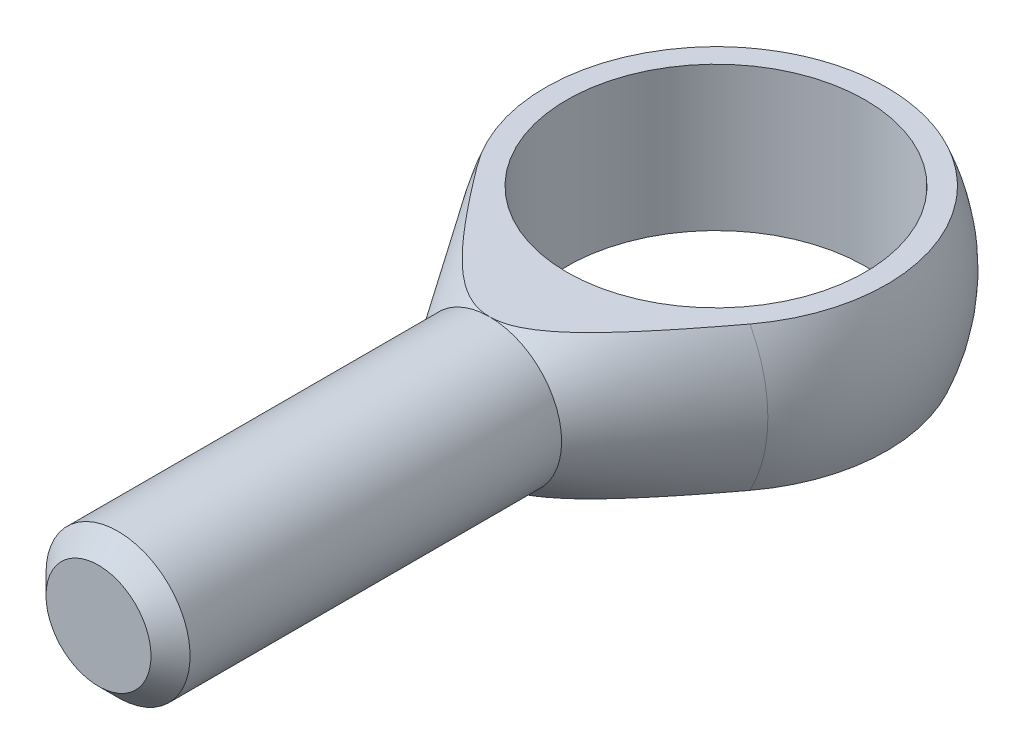
ISO-10303-21;
HEADER;
FILE_DESCRIPTION(('STEP AP214'),'2;1');
FILE_NAME('part.step','',(''),(''),'','','');
FILE_SCHEMA(('AUTOMOTIVE_DESIGN { 1 0 10303 214 1 1 1 1 }'));
ENDSEC;
DATA;
#1=APPLICATION_CONTEXT('core data for automotive mechanical design processes');
#2=APPLICATION_PROTOCOL_DEFINITION('international standard','automotive_design',2000,#1);
#3=PRODUCT_CONTEXT('',#1,'mechanical');
#4=PRODUCT('Part','Part','',(#3));
#5=PRODUCT_RELATED_PRODUCT_CATEGORY('part','',(#4));
#6=PRODUCT_DEFINITION_FORMATION('','',#4);
#7=PRODUCT_DEFINITION_CONTEXT('part definition',#1,'design');
#8=PRODUCT_DEFINITION('design','',#6,#7);
#9=PRODUCT_DEFINITION_SHAPE('','',#8);
#10=(LENGTH_UNIT() NAMED_UNIT(*) SI_UNIT(.MILLI.,.METRE.));
#11=(NAMED_UNIT(*) PLANE_ANGLE_UNIT() SI_UNIT($,.RADIAN.));
#12=(NAMED_UNIT(*) SI_UNIT($,.STERADIAN.) SOLID_ANGLE_UNIT());
#13=UNCERTAINTY_MEASURE_WITH_UNIT(LENGTH_MEASURE(1.E-05),#10,'distance_accuracy_value','');
#14=(GEOMETRIC_REPRESENTATION_CONTEXT(3) GLOBAL_UNCERTAINTY_ASSIGNED_CONTEXT((#13)) GLOBAL_UNIT_ASSIGNED_CONTEXT((#10,
#11,#12)) REPRESENTATION_CONTEXT('',''));
#15=CARTESIAN_POINT('',(0.,0.,0.));
#16=DIRECTION('',(0.,0.,1.));
#17=DIRECTION('',(1.,0.,0.));
#18=AXIS2_PLACEMENT_3D('',#15,#16,#17);
#19=CARTESIAN_POINT('',(0.,0.,22.));
#20=DIRECTION('',(0.,0.,-1.));
#21=DIRECTION('',(-1.,0.,0.));
#22=AXIS2_PLACEMENT_3D('',#19,#20,#21);
#23=CONICAL_SURFACE('',#22,7.,0.586080353273644);
#24=CARTESIAN_POINT('',(0.,0.,9.95579574269246));
#25=DIRECTION('',(0.,0.,-1.));
#26=DIRECTION('',(-1.,0.,0.));
#27=AXIS2_PLACEMENT_3D('',#24,#25,#26);
#28=CIRCLE('',#27,14.9960705229666);
#29=CARTESIAN_POINT('',(-13.2620560672087,-7.,9.95579574269246));
#30=VERTEX_POINT('',#29);
#31=CARTESIAN_POINT('',(-13.2620560672087,7.,9.95579574269246));
#32=VERTEX_POINT('',#31);
#33=EDGE_CURVE('E97',#30,#32,#28,.T.);
#34=ORIENTED_EDGE('',*,*,#33,.F.);
#35=CARTESIAN_POINT('',(-35.7749330406198,-7.,-22.364543191274));
#36=CARTESIAN_POINT('',(-35.2557457418538,-7.,-21.5970666918137));
#37=CARTESIAN_POINT('',(-34.7362762210325,-7.,-20.8297811400058));
#38=CARTESIAN_POINT('',(-33.6966834144319,-7.,-19.2956524673114));
#39=CARTESIAN_POINT('',(-33.176560128298,-7.,-18.5288093466651));
#40=CARTESIAN_POINT('',(-31.6149481261384,-7.,-16.2288466338894));
#41=CARTESIAN_POINT('',(-30.5723452600432,-7.,-14.6964829896334));
#42=CARTESIAN_POINT('',(-28.4792793196588,-7.,-11.6287926346319));
#43=CARTESIAN_POINT('',(-27.4288014344379,-7.,-10.0934760258834));
#44=CARTESIAN_POINT('',(-25.3224132619239,-7.,-7.02683031825795));
#45=CARTESIAN_POINT('',(-24.2665036180706,-7.,-5.49550077803563));
#46=CARTESIAN_POINT('',(-22.6197204042876,-7.,-3.12071896107828));
#47=CARTESIAN_POINT('',(-22.0316497439147,-7.,-2.27532350169602));
#48=CARTESIAN_POINT('',(-20.8523754110616,-7.,-0.586721538908334));
#49=CARTESIAN_POINT('',(-20.261171744375,-7.,0.256484968540639));
#50=CARTESIAN_POINT('',(-19.0745404522942,-7.,1.94039790687613));
#51=CARTESIAN_POINT('',(-18.479111322321,-7.,2.78110327856402));
#52=CARTESIAN_POINT('',(-17.283024706769,-7.,4.45875767536112));
#53=CARTESIAN_POINT('',(-16.6823673535929,-7.,5.29570679478707));
#54=CARTESIAN_POINT('',(-15.4753430188765,-7.,6.96269811189941));
#55=CARTESIAN_POINT('',(-14.8689914367507,-7.,7.79275142729022));
#56=CARTESIAN_POINT('',(-13.9520975640749,-7.,9.03245633424442));
#57=CARTESIAN_POINT('',(-13.6452208819987,-7.,9.44481873024202));
#58=CARTESIAN_POINT('',(-13.0285191148171,-7.,10.2673324129423));
#59=CARTESIAN_POINT('',(-12.7186940433328,-7.,10.6774837098463));
#60=CARTESIAN_POINT('',(-12.0956715350432,-7.,11.4948106695872));
#61=CARTESIAN_POINT('',(-11.7824763504141,-7.,11.9019880473005));
#62=CARTESIAN_POINT('',(-11.1517095906708,-7.,12.7129374332678));
#63=CARTESIAN_POINT('',(-10.8341380686633,-7.,13.1167094827497));
#64=CARTESIAN_POINT('',(-10.1935897495339,-7.,13.9198283190024));
#65=CARTESIAN_POINT('',(-9.87061395256993,-7.,14.3191759023512));
#66=CARTESIAN_POINT('',(-9.21774476320522,-7.,15.1121662786666));
#67=CARTESIAN_POINT('',(-8.88785179033026,-7.,15.5058094151724));
#68=CARTESIAN_POINT('',(-8.47330461901117,-7.,15.9890251921758));
#69=CARTESIAN_POINT('',(-8.39288771792456,-7.,16.0822397626497));
#70=CARTESIAN_POINT('',(-8.23149652455924,-7.,16.2681860780628));
#71=CARTESIAN_POINT('',(-8.15052222922019,-7.,16.3609178203461));
#72=CARTESIAN_POINT('',(-7.90670329867922,-7.,16.6383368353352));
#73=CARTESIAN_POINT('',(-7.74296708261695,-7.,16.8222426839337));
#74=CARTESIAN_POINT('',(-7.41269551183481,-7.,17.187669240366));
#75=CARTESIAN_POINT('',(-7.24615899128196,-7.,17.3691888957787));
#76=CARTESIAN_POINT('',(-6.90993072460535,-7.,17.7292828947874));
#77=CARTESIAN_POINT('',(-6.74023902707467,-7.,17.907857283664));
#78=CARTESIAN_POINT('',(-6.39832456051447,-7.,18.2602745619847));
#79=CARTESIAN_POINT('',(-6.22612614934961,-7.,18.4341410297398));
#80=CARTESIAN_POINT('',(-5.87750130265463,-7.,18.777578750902));
#81=CARTESIAN_POINT('',(-5.70107507321759,-7.,18.9471502128518));
#82=CARTESIAN_POINT('',(-5.34334844564706,-7.,19.2808802367186));
#83=CARTESIAN_POINT('',(-5.16205090731351,-7.,19.4450418537778));
#84=CARTESIAN_POINT('',(-4.7936214362123,-7.,19.7666557471395));
#85=CARTESIAN_POINT('',(-4.60649059922228,-7.,19.9241092705527));
#86=CARTESIAN_POINT('',(-4.26948714608075,-7.,20.1949425491286));
#87=CARTESIAN_POINT('',(-4.12103022034314,-7.,20.3100799649733));
#88=CARTESIAN_POINT('',(-3.81949091420309,-7.,20.5341606496789));
#89=CARTESIAN_POINT('',(-3.66640858152046,-7.,20.64310398241));
#90=CARTESIAN_POINT('',(-3.35471148915117,-7.,20.8535847470688));
#91=CARTESIAN_POINT('',(-3.19608530103455,-7.,20.9551053619598));
#92=CARTESIAN_POINT('',(-2.87306914673421,-7.,21.148627208181));
#93=CARTESIAN_POINT('',(-2.70867878773045,-7.,21.2406277890396));
#94=CARTESIAN_POINT('',(-2.3705669601187,-7.,21.4144147823643));
#95=CARTESIAN_POINT('',(-2.19672767573215,-7.,21.4959744915405));
#96=CARTESIAN_POINT('',(-1.84259733991625,-7.,21.6438391418119));
#97=CARTESIAN_POINT('',(-1.66230650330884,-7.,21.7101445902939));
#98=CARTESIAN_POINT('',(-1.29677977192926,-7.,21.8239610010033));
#99=CARTESIAN_POINT('',(-1.11157296335153,-7.,21.871563884485));
#100=CARTESIAN_POINT('',(-0.736937715346063,-7.,21.945412636619));
#101=CARTESIAN_POINT('',(-0.547511238142772,-7.,21.9716682276162));
#102=CARTESIAN_POINT('',(-0.193652612813675,-7.,21.9988392502901));
#103=CARTESIAN_POINT('',(-0.0294516562980215,-7.,22.0027989505114));
#104=CARTESIAN_POINT('',(0.298435483918341,-7.,21.9933092028262));
#105=CARTESIAN_POINT('',(0.462121701717755,-7.,21.9798609335421));
#106=CARTESIAN_POINT('',(0.787583203686881,-7.,21.9362904703374));
#107=CARTESIAN_POINT('',(0.949353614789869,-7.,21.906132439325));
#108=CARTESIAN_POINT('',(1.26931315408095,-7.,21.8307037570719));
#109=CARTESIAN_POINT('',(1.42750145035563,-7.,21.7854296329253));
#110=CARTESIAN_POINT('',(1.77988046427218,-7.,21.6683217875983));
#111=CARTESIAN_POINT('',(1.97278746842812,-7.,21.5926463734846));
#112=CARTESIAN_POINT('',(2.35109490226876,-7.,21.4245050560995));
#113=CARTESIAN_POINT('',(2.53649215764712,-7.,21.3320321414028));
#114=CARTESIAN_POINT('',(2.90051798006167,-7.,21.133548885041));
#115=CARTESIAN_POINT('',(3.07912517025464,-7.,21.0274997504075));
#116=CARTESIAN_POINT('',(3.4295875329644,-7.,20.8049541113989));
#117=CARTESIAN_POINT('',(3.60144431341052,-7.,20.6884601169308));
#118=CARTESIAN_POINT('',(3.91191222623654,-7.,20.4666964111047));
#119=CARTESIAN_POINT('',(4.05140788374108,-7.,20.3626550537725));
#120=CARTESIAN_POINT('',(4.32667190571702,-7.,20.1497406643287));
#121=CARTESIAN_POINT('',(4.46243986853867,-7.,20.0408671148418));
#122=CARTESIAN_POINT('',(4.86492235875525,-7.,19.7081280613203));
#123=CARTESIAN_POINT('',(5.12666880117029,-7.,19.4782513743433));
#124=CARTESIAN_POINT('',(5.64027049450144,-7.,19.0066261457026));
#125=CARTESIAN_POINT('',(5.89210027214738,-7.,18.7648502168376));
#126=CARTESIAN_POINT('',(6.38732226614094,-7.,18.2729754493109));
#127=CARTESIAN_POINT('',(6.63071679155033,-7.,18.022878925658));
#128=CARTESIAN_POINT('',(7.112269520069,-7.,17.5147782469323));
#129=CARTESIAN_POINT('',(7.35038600362861,-7.,17.256734737553));
#130=CARTESIAN_POINT('',(7.821107988416,-7.,16.7356564961187));
#131=CARTESIAN_POINT('',(8.05371316828983,-7.,16.4726214746205));
#132=CARTESIAN_POINT('',(8.51402439097885,-7.,15.943023137621));
#133=CARTESIAN_POINT('',(8.7417374626886,-7.,15.6764659167488));
#134=CARTESIAN_POINT('',(9.19338997581038,-7.,15.1401932236206));
#135=CARTESIAN_POINT('',(9.41732953446576,-7.,14.8704778499315));
#136=CARTESIAN_POINT('',(9.85842553695496,-7.,14.3328639579327));
#137=CARTESIAN_POINT('',(10.0756330613075,-7.,14.0650072912833));
#138=CARTESIAN_POINT('',(10.5074407732847,-7.,13.5271990914724));
#139=CARTESIAN_POINT('',(10.7220409363361,-7.,13.2572475386068));
#140=CARTESIAN_POINT('',(11.3625220510265,-7.,12.4447395150769));
#141=CARTESIAN_POINT('',(11.7850655390273,-7.,11.8995518675478));
#142=CARTESIAN_POINT('',(12.6235427441418,-7.,10.8039817775548));
#143=CARTESIAN_POINT('',(13.0394752696116,-7.,10.2535984264213));
#144=CARTESIAN_POINT('',(13.8661746140222,-7.,9.14896127950245));
#145=CARTESIAN_POINT('',(14.2769413791678,-7.,8.59470744350407));
#146=CARTESIAN_POINT('',(15.0948308380742,-7.,7.482617949876));
#147=CARTESIAN_POINT('',(15.5019492176313,-7.,6.92477912363595));
#148=CARTESIAN_POINT('',(16.312907899028,-7.,5.8067215840899));
#149=CARTESIAN_POINT('',(16.7167481847817,-7.,5.24650285912593));
#150=CARTESIAN_POINT('',(17.5217113458166,-7.,4.12421135621869));
#151=CARTESIAN_POINT('',(17.9228345158846,-7.,3.56213878957017));
#152=CARTESIAN_POINT('',(18.7228697941856,-7.,2.43642225680694));
#153=CARTESIAN_POINT('',(19.1217818999099,-7.,1.87277828891023));
#154=CARTESIAN_POINT('',(20.3121285599489,-7.,0.185060271051221));
#155=CARTESIAN_POINT('',(21.1008432418333,-7.,-0.940932001672015));
#156=CARTESIAN_POINT('',(22.6730668043922,-7.,-3.19658296464595));
#157=CARTESIAN_POINT('',(23.4565755487086,-7.,-4.32624174978839));
#158=CARTESIAN_POINT('',(25.0193558881569,-7.,-6.58778112055454));
#159=CARTESIAN_POINT('',(25.7986291312,-7.,-7.71966056796844));
#160=CARTESIAN_POINT('',(27.3541881344403,-7.,-9.98547051992714));
#161=CARTESIAN_POINT('',(28.1304738925979,-7.,-11.1194010258715));
#162=CARTESIAN_POINT('',(29.479603864552,-7.,-13.0944636179223));
#163=CARTESIAN_POINT('',(30.0529771608741,-7.,-13.9352344525402));
#164=CARTESIAN_POINT('',(31.1986850021324,-7.,-15.6175888971328));
#165=CARTESIAN_POINT('',(31.7710194539251,-7.,-16.459172570535));
#166=CARTESIAN_POINT('',(32.915767397702,-7.,-18.1444464753605));
#167=CARTESIAN_POINT('',(33.4881792638798,-7.,-18.9881378109397));
#168=CARTESIAN_POINT('',(34.6321510704091,-7.,-20.6759910229837));
#169=CARTESIAN_POINT('',(35.2037110803881,-7.,-21.5201528522547));
#170=CARTESIAN_POINT('',(35.7749330406198,-7.,-22.364543191274));
#171=B_SPLINE_CURVE_WITH_KNOTS('',3,(#35,#36,#37,#38,#39,#40,#41,#42,#43,#44,#45,#46,#47,#48,
#49,#50,#51,#52,#53,#54,#55,#56,#57,#58,#59,#60,#61,#62,#63,#64,#65,#66,#67,#68,#69,#70,#71,#72,
#73,#74,#75,#76,#77,#78,#79,#80,#81,#82,#83,#84,#85,#86,#87,#88,#89,#90,#91,#92,#93,#94,#95,#96,
#97,#98,#99,#100,#101,#102,#103,#104,#105,#106,#107,#108,#109,#110,#111,#112,#113,#114,#115,
#116,#117,#118,#119,#120,#121,#122,#123,#124,#125,#126,#127,#128,#129,#130,#131,#132,#133,#134,
#135,#136,#137,#138,#139,#140,#141,#142,#143,#144,#145,#146,#147,#148,#149,#150,#151,#152,#153,
#154,#155,#156,#157,#158,#159,#160,#161,#162,#163,#164,#165,#166,#167,#168,#169,#170),
.UNSPECIFIED.,.F.,.F.,(4,2,2,2,2,2,2,2,2,2,2,2,2,2,2,2,2,2,2,2,2,2,2,2,2,2,2,2,2,2,2,2,2,2,2,2,
2,2,2,2,2,2,2,2,2,2,2,2,2,2,2,2,2,2,2,2,2,2,2,2,2,2,2,2,2,2,2,4),(0.,2.77978052532656,
5.55956255904541,11.1198121526959,16.7006924991323,22.2809263033817,25.3703683693448,
28.4598047242588,31.5504026684809,34.6409225709526,37.7246688568328,39.266717200502,
40.8087584235731,42.3498262689162,43.8908754298879,45.4316424791195,46.972316349807,
47.3416417424662,47.7109691645043,48.4496445942001,49.188635564589,49.9276151631429,
50.6616771450007,51.3957034161036,52.1293077924101,52.8627751828107,53.42626375283,
53.9897465113852,54.5544687011213,55.1192294509547,55.6946968339548,56.2701450730042,
56.8427285599069,57.4150511248501,57.9068900893585,58.3986957552033,58.8915602925694,
59.3845381430323,60.0051641062353,60.6260497219865,61.2487508146716,61.8713026708664,
62.3932499405417,62.9152532297662,63.9598039031512,65.0068827350574,66.0536726390399,
67.1069397342398,68.1602680931136,69.2119652889144,70.2636297479267,71.2981813962505,
72.3327427872266,74.4019514395513,76.4715289364474,78.5411279676274,80.6129161662765,
82.6847145253371,84.7562843890927,86.8278566029889,90.9520738791828,95.0763987577473,
99.1989839040365,103.321571864503,106.374581429789,109.427852399785,112.48648457713,
115.544851294055),.UNSPECIFIED.);
#172=CARTESIAN_POINT('',(0.,-7.00000000000001,22.));
#173=VERTEX_POINT('',#172);
#174=EDGE_CURVE('E93',#30,#173,#171,.T.);
#175=ORIENTED_EDGE('',*,*,#174,.T.);
#176=CARTESIAN_POINT('',(0.,0.,22.));
#177=DIRECTION('',(0.,0.,-1.));
#178=DIRECTION('',(-1.,0.,0.));
#179=AXIS2_PLACEMENT_3D('',#176,#177,#178);
#180=CIRCLE('',#179,7.);
#181=CARTESIAN_POINT('',(0.,7.00000000000001,22.));
#182=VERTEX_POINT('',#181);
#183=EDGE_CURVE('E92',#173,#182,#180,.T.);
#184=ORIENTED_EDGE('',*,*,#183,.T.);
#185=CARTESIAN_POINT('',(35.7749330406198,7.,-22.364543191274));
#186=CARTESIAN_POINT('',(35.2557457418538,7.,-21.5970666918137));
#187=CARTESIAN_POINT('',(34.7362762210325,7.,-20.8297811400058));
#188=CARTESIAN_POINT('',(33.6966834144319,7.,-19.2956524673114));
#189=CARTESIAN_POINT('',(33.176560128298,7.,-18.5288093466651));
#190=CARTESIAN_POINT('',(31.6149481261384,7.,-16.2288466338893));
#191=CARTESIAN_POINT('',(30.5723452600432,7.,-14.6964829896334));
#192=CARTESIAN_POINT('',(28.4792793196588,7.,-11.6287926346319));
#193=CARTESIAN_POINT('',(27.4288014344378,7.,-10.0934760258834));
#194=CARTESIAN_POINT('',(25.3224132619239,7.,-7.02683031825793));
#195=CARTESIAN_POINT('',(24.2665036180706,7.,-5.4955007780356));
#196=CARTESIAN_POINT('',(22.6197204042876,7.,-3.12071896107825));
#197=CARTESIAN_POINT('',(22.0316497439147,7.,-2.275323501696));
#198=CARTESIAN_POINT('',(20.8523754110616,7.,-0.586721538908313));
#199=CARTESIAN_POINT('',(20.2611717443749,7.,0.256484968540659));
#200=CARTESIAN_POINT('',(19.0745404522942,7.,1.94039790687615));
#201=CARTESIAN_POINT('',(18.4791113223209,7.,2.78110327856404));
#202=CARTESIAN_POINT('',(17.283024706769,7.,4.45875767536114));
#203=CARTESIAN_POINT('',(16.6823673535929,7.,5.29570679478709));
#204=CARTESIAN_POINT('',(15.4753430188765,7.,6.96269811189943));
#205=CARTESIAN_POINT('',(14.8689914367507,7.,7.79275142729024));
#206=CARTESIAN_POINT('',(13.9520975640749,7.,9.03245633424443));
#207=CARTESIAN_POINT('',(13.6452208819987,7.,9.44481873024203));
#208=CARTESIAN_POINT('',(13.0285191148171,7.,10.2673324129423));
#209=CARTESIAN_POINT('',(12.7186940433328,7.,10.6774837098463));
#210=CARTESIAN_POINT('',(12.0956715350431,7.,11.4948106695872));
#211=CARTESIAN_POINT('',(11.7824763504141,7.,11.9019880473005));
#212=CARTESIAN_POINT('',(11.1517095906708,7.,12.7129374332678));
#213=CARTESIAN_POINT('',(10.8341380686633,7.,13.1167094827497));
#214=CARTESIAN_POINT('',(10.1935897495339,7.,13.9198283190024));
#215=CARTESIAN_POINT('',(9.87061395256992,7.,14.3191759023512));
#216=CARTESIAN_POINT('',(9.21774476320522,7.,15.1121662786666));
#217=CARTESIAN_POINT('',(8.88785179033026,7.,15.5058094151724));
#218=CARTESIAN_POINT('',(8.47330461901117,7.,15.9890251921758));
#219=CARTESIAN_POINT('',(8.39288771792456,7.,16.0822397626497));
#220=CARTESIAN_POINT('',(8.23149652455924,7.,16.2681860780628));
#221=CARTESIAN_POINT('',(8.15052222922019,7.,16.3609178203461));
#222=CARTESIAN_POINT('',(7.90670329867922,7.,16.6383368353352));
#223=CARTESIAN_POINT('',(7.74296708261695,7.,16.8222426839337));
#224=CARTESIAN_POINT('',(7.41269551183481,7.,17.187669240366));
#225=CARTESIAN_POINT('',(7.24615899128196,7.,17.3691888957787));
#226=CARTESIAN_POINT('',(6.90993072460534,7.,17.7292828947875));
#227=CARTESIAN_POINT('',(6.74023902707466,7.,17.907857283664));
#228=CARTESIAN_POINT('',(6.39832456051447,7.,18.2602745619847));
#229=CARTESIAN_POINT('',(6.22612614934961,7.,18.4341410297398));
#230=CARTESIAN_POINT('',(5.87750130265462,7.,18.777578750902));
#231=CARTESIAN_POINT('',(5.70107507321758,7.,18.9471502128518));
#232=CARTESIAN_POINT('',(5.34334844564705,7.,19.2808802367186));
#233=CARTESIAN_POINT('',(5.16205090731351,7.,19.4450418537778));
#234=CARTESIAN_POINT('',(4.79362143621229,7.,19.7666557471395));
#235=CARTESIAN_POINT('',(4.60649059922227,7.,19.9241092705527));
#236=CARTESIAN_POINT('',(4.26948714608075,7.,20.1949425491286));
#237=CARTESIAN_POINT('',(4.12103022034313,7.,20.3100799649733));
#238=CARTESIAN_POINT('',(3.81949091420308,7.,20.5341606496789));
#239=CARTESIAN_POINT('',(3.66640858152046,7.,20.64310398241));
#240=CARTESIAN_POINT('',(3.35471148915117,7.,20.8535847470688));
#241=CARTESIAN_POINT('',(3.19608530103454,7.,20.9551053619598));
#242=CARTESIAN_POINT('',(2.8730691467342,7.,21.148627208181));
#243=CARTESIAN_POINT('',(2.70867878773045,7.,21.2406277890396));
#244=CARTESIAN_POINT('',(2.37056696011869,7.,21.4144147823643));
#245=CARTESIAN_POINT('',(2.19672767573215,7.,21.4959744915405));
#246=CARTESIAN_POINT('',(1.84259733991624,7.,21.6438391418119));
#247=CARTESIAN_POINT('',(1.66230650330883,7.,21.7101445902939));
#248=CARTESIAN_POINT('',(1.29677977192926,7.,21.8239610010033));
#249=CARTESIAN_POINT('',(1.11157296335152,7.,21.871563884485));
#250=CARTESIAN_POINT('',(0.736937715346061,7.,21.945412636619));
#251=CARTESIAN_POINT('',(0.547511238142773,7.,21.9716682276162));
#252=CARTESIAN_POINT('',(0.193652612813678,7.,21.9988392502901));
#253=CARTESIAN_POINT('',(0.0294516562980239,7.,22.0027989505114));
#254=CARTESIAN_POINT('',(-0.298435483918341,7.,21.9933092028262));
#255=CARTESIAN_POINT('',(-0.462121701717758,7.,21.9798609335421));
#256=CARTESIAN_POINT('',(-0.787583203686883,7.,21.9362904703374));
#257=CARTESIAN_POINT('',(-0.949353614789869,7.,21.906132439325));
#258=CARTESIAN_POINT('',(-1.26931315408095,7.,21.8307037570719));
#259=CARTESIAN_POINT('',(-1.42750145035563,7.,21.7854296329253));
#260=CARTESIAN_POINT('',(-1.77988046427218,7.,21.6683217875983));
#261=CARTESIAN_POINT('',(-1.97278746842811,7.,21.5926463734846));
#262=CARTESIAN_POINT('',(-2.35109490226876,7.,21.4245050560995));
#263=CARTESIAN_POINT('',(-2.53649215764711,7.,21.3320321414028));
#264=CARTESIAN_POINT('',(-2.90051798006166,7.,21.133548885041));
#265=CARTESIAN_POINT('',(-3.07912517025464,7.,21.0274997504075));
#266=CARTESIAN_POINT('',(-3.42958753296439,7.,20.804954111399));
#267=CARTESIAN_POINT('',(-3.60144431341052,7.,20.6884601169308));
#268=CARTESIAN_POINT('',(-3.91191222623654,7.,20.4666964111047));
#269=CARTESIAN_POINT('',(-4.05140788374108,7.,20.3626550537725));
#270=CARTESIAN_POINT('',(-4.32667190571703,7.,20.1497406643287));
#271=CARTESIAN_POINT('',(-4.46243986853868,7.,20.0408671148417));
#272=CARTESIAN_POINT('',(-4.86492235875526,7.,19.7081280613203));
#273=CARTESIAN_POINT('',(-5.12666880117029,7.,19.4782513743433));
#274=CARTESIAN_POINT('',(-5.64027049450145,7.,19.0066261457026));
#275=CARTESIAN_POINT('',(-5.89210027214738,7.,18.7648502168376));
#276=CARTESIAN_POINT('',(-6.38732226614094,7.,18.2729754493109));
#277=CARTESIAN_POINT('',(-6.63071679155033,7.,18.022878925658));
#278=CARTESIAN_POINT('',(-7.112269520069,7.,17.5147782469323));
#279=CARTESIAN_POINT('',(-7.35038600362861,7.,17.256734737553));
#280=CARTESIAN_POINT('',(-7.821107988416,7.,16.7356564961187));
#281=CARTESIAN_POINT('',(-8.05371316828983,7.,16.4726214746205));
#282=CARTESIAN_POINT('',(-8.51402439097885,7.,15.943023137621));
#283=CARTESIAN_POINT('',(-8.7417374626886,7.,15.6764659167488));
#284=CARTESIAN_POINT('',(-9.19338997581038,7.,15.1401932236206));
#285=CARTESIAN_POINT('',(-9.41732953446576,7.,14.8704778499315));
#286=CARTESIAN_POINT('',(-9.85842553695496,7.,14.3328639579327));
#287=CARTESIAN_POINT('',(-10.0756330613075,7.,14.0650072912833));
#288=CARTESIAN_POINT('',(-10.5074407732847,7.,13.5271990914724));
#289=CARTESIAN_POINT('',(-10.7220409363361,7.,13.2572475386068));
#290=CARTESIAN_POINT('',(-11.3625220510265,7.,12.4447395150769));
#291=CARTESIAN_POINT('',(-11.7850655390273,7.,11.8995518675478));
#292=CARTESIAN_POINT('',(-12.6235427441418,7.,10.8039817775548));
#293=CARTESIAN_POINT('',(-13.0394752696116,7.,10.2535984264213));
#294=CARTESIAN_POINT('',(-13.8661746140222,7.,9.14896127950247));
#295=CARTESIAN_POINT('',(-14.2769413791678,7.,8.59470744350408));
#296=CARTESIAN_POINT('',(-15.0948308380742,7.,7.48261794987601));
#297=CARTESIAN_POINT('',(-15.5019492176313,7.,6.92477912363596));
#298=CARTESIAN_POINT('',(-16.312907899028,7.,5.80672158408991));
#299=CARTESIAN_POINT('',(-16.7167481847817,7.,5.24650285912594));
#300=CARTESIAN_POINT('',(-17.5217113458166,7.,4.1242113562187));
#301=CARTESIAN_POINT('',(-17.9228345158846,7.,3.56213878957018));
#302=CARTESIAN_POINT('',(-18.7228697941856,7.,2.43642225680694));
#303=CARTESIAN_POINT('',(-19.1217818999098,7.,1.87277828891024));
#304=CARTESIAN_POINT('',(-20.3121285599489,7.,0.185060271051222));
#305=CARTESIAN_POINT('',(-21.1008432418333,7.,-0.940932001672015));
#306=CARTESIAN_POINT('',(-22.6730668043922,7.,-3.19658296464595));
#307=CARTESIAN_POINT('',(-23.4565755487086,7.,-4.32624174978839));
#308=CARTESIAN_POINT('',(-25.0193558881569,7.,-6.58778112055453));
#309=CARTESIAN_POINT('',(-25.7986291312,7.,-7.71966056796843));
#310=CARTESIAN_POINT('',(-27.3541881344403,7.,-9.98547051992713));
#311=CARTESIAN_POINT('',(-28.1304738925979,7.,-11.1194010258715));
#312=CARTESIAN_POINT('',(-29.479603864552,7.,-13.0944636179223));
#313=CARTESIAN_POINT('',(-30.0529771608741,7.,-13.9352344525402));
#314=CARTESIAN_POINT('',(-31.1986850021324,7.,-15.6175888971328));
#315=CARTESIAN_POINT('',(-31.7710194539251,7.,-16.459172570535));
#316=CARTESIAN_POINT('',(-32.915767397702,7.,-18.1444464753605));
#317=CARTESIAN_POINT('',(-33.4881792638798,7.,-18.9881378109397));
#318=CARTESIAN_POINT('',(-34.6321510704091,7.,-20.6759910229837));
#319=CARTESIAN_POINT('',(-35.2037110803881,7.,-21.5201528522547));
#320=CARTESIAN_POINT('',(-35.7749330406198,7.,-22.364543191274));
#321=B_SPLINE_CURVE_WITH_KNOTS('',3,(#185,#186,#187,#188,#189,#190,#191,#192,#193,#194,#195,
#196,#197,#198,#199,#200,#201,#202,#203,#204,#205,#206,#207,#208,#209,#210,#211,#212,#213,#214,
#215,#216,#217,#218,#219,#220,#221,#222,#223,#224,#225,#226,#227,#228,#229,#230,#231,#232,#233,
#234,#235,#236,#237,#238,#239,#240,#241,#242,#243,#244,#245,#246,#247,#248,#249,#250,#251,#252,
#253,#254,#255,#256,#257,#258,#259,#260,#261,#262,#263,#264,#265,#266,#267,#268,#269,#270,#271,
#272,#273,#274,#275,#276,#277,#278,#279,#280,#281,#282,#283,#284,#285,#286,#287,#288,#289,#290,
#291,#292,#293,#294,#295,#296,#297,#298,#299,#300,#301,#302,#303,#304,#305,#306,#307,#308,#309,
#310,#311,#312,#313,#314,#315,#316,#317,#318,#319,#320),.UNSPECIFIED.,.F.,.F.,(4,2,2,2,2,2,2,2,
2,2,2,2,2,2,2,2,2,2,2,2,2,2,2,2,2,2,2,2,2,2,2,2,2,2,2,2,2,2,2,2,2,2,2,2,2,2,2,2,2,2,2,2,2,2,2,2,
2,2,2,2,2,2,2,2,2,2,2,4),(0.,2.77978052532656,5.55956255904541,11.1198121526959,
16.7006924991323,22.2809263033818,25.3703683693449,28.4598047242588,31.5504026684809,
34.6409225709526,37.7246688568328,39.266717200502,40.8087584235731,42.3498262689162,
43.8908754298879,45.4316424791195,46.9723163498069,47.3416417424662,47.7109691645043,
48.4496445942001,49.188635564589,49.9276151631429,50.6616771450007,51.3957034161036,
52.1293077924101,52.8627751828107,53.42626375283,53.9897465113852,54.5544687011213,
55.1192294509547,55.6946968339548,56.2701450730042,56.8427285599069,57.4150511248501,
57.9068900893585,58.3986957552033,58.8915602925694,59.3845381430323,60.0051641062353,
60.6260497219865,61.2487508146716,61.8713026708664,62.3932499405417,62.9152532297662,
63.9598039031512,65.0068827350574,66.0536726390398,67.1069397342398,68.1602680931136,
69.2119652889144,70.2636297479267,71.2981813962504,72.3327427872266,74.4019514395512,
76.4715289364474,78.5411279676274,80.6129161662765,82.6847145253371,84.7562843890927,
86.8278566029889,90.9520738791827,95.0763987577473,99.1989839040364,103.321571864503,
106.374581429789,109.427852399785,112.48648457713,115.544851294055),.UNSPECIFIED.);
#322=EDGE_CURVE('E72',#182,#32,#321,.T.);
#323=ORIENTED_EDGE('',*,*,#322,.T.);
#324=EDGE_LOOP('',(#34,#175,#184,#323));
#325=FACE_BOUND('',#324,.T.);
#326=ADVANCED_FACE('F37',(#325),#23,.T.);
#327=EDGE_CURVE('E87',#182,#173,#180,.T.);
#328=ORIENTED_EDGE('',*,*,#327,.T.);
#329=CARTESIAN_POINT('',(13.2620560672087,-7.,9.95579574269246));
#330=VERTEX_POINT('',#329);
#331=EDGE_CURVE('E89',#173,#330,#171,.T.);
#332=ORIENTED_EDGE('',*,*,#331,.T.);
#333=CARTESIAN_POINT('',(13.2620560672087,7.,9.95579574269246));
#334=VERTEX_POINT('',#333);
#335=EDGE_CURVE('E88',#334,#330,#28,.T.);
#336=ORIENTED_EDGE('',*,*,#335,.F.);
#337=EDGE_CURVE('E75',#334,#182,#321,.T.);
#338=ORIENTED_EDGE('',*,*,#337,.T.);
#339=EDGE_LOOP('',(#328,#332,#336,#338));
#340=FACE_BOUND('',#339,.T.);
#341=ADVANCED_FACE('F85',(#340),#23,.T.);
#342=CARTESIAN_POINT('',(0.,0.,0.));
#343=DIRECTION('',(0.,0.,-1.));
#344=DIRECTION('',(1.,0.,0.));
#345=AXIS2_PLACEMENT_3D('',#342,#343,#344);
#346=SPHERICAL_SURFACE('',#345,18.);
#347=CARTESIAN_POINT('',(0.,-7.,0.));
#348=DIRECTION('',(0.,1.,0.));
#349=DIRECTION('',(0.,0.,1.));
#350=AXIS2_PLACEMENT_3D('',#347,#348,#349);
#351=CIRCLE('',#350,16.583123951777);
#352=EDGE_CURVE('E53',#330,#30,#351,.T.);
#353=ORIENTED_EDGE('',*,*,#352,.T.);
#354=ORIENTED_EDGE('',*,*,#33,.T.);
#355=CARTESIAN_POINT('',(0.,7.,0.));
#356=DIRECTION('',(0.,-1.,0.));
#357=DIRECTION('',(0.,0.,-1.));
#358=AXIS2_PLACEMENT_3D('',#355,#356,#357);
#359=CIRCLE('',#358,16.583123951777);
#360=EDGE_CURVE('E77',#32,#334,#359,.T.);
#361=ORIENTED_EDGE('',*,*,#360,.T.);
#362=ORIENTED_EDGE('',*,*,#335,.T.);
#363=EDGE_LOOP('',(#353,#354,#361,#362));
#364=FACE_BOUND('',#363,.T.);
#365=ADVANCED_FACE('F125',(#364),#346,.T.);
#366=CARTESIAN_POINT('',(0.,0.,60.));
#367=DIRECTION('',(0.,0.,-1.));
#368=DIRECTION('',(-1.,0.,0.));
#369=AXIS2_PLACEMENT_3D('',#366,#367,#368);
#370=PLANE('',#369);
#371=CARTESIAN_POINT('',(0.,0.,60.));
#372=DIRECTION('',(0.,0.,-1.));
#373=DIRECTION('',(-1.,0.,0.));
#374=AXIS2_PLACEMENT_3D('',#371,#372,#373);
#375=CIRCLE('',#374,5.09999999999999);
#376=CARTESIAN_POINT('',(-5.09999999999999,0.,60.));
#377=VERTEX_POINT('',#376);
#378=EDGE_CURVE('E11',#377,#377,#375,.F.);
#379=ORIENTED_EDGE('',*,*,#378,.T.);
#380=EDGE_LOOP('',(#379));
#381=FACE_BOUND('',#380,.T.);
#382=ADVANCED_FACE('F143',(#381),#370,.F.);
#383=CARTESIAN_POINT('',(0.,0.,-26.0435164980697));
#384=DIRECTION('',(0.,0.,-1.));
#385=DIRECTION('',(-1.,0.,0.));
#386=AXIS2_PLACEMENT_3D('',#383,#384,#385);
#387=CYLINDRICAL_SURFACE('',#386,7.);
#388=CARTESIAN_POINT('',(0.,0.,58.1));
#389=DIRECTION('',(0.,0.,-1.));
#390=DIRECTION('',(-1.,0.,0.));
#391=AXIS2_PLACEMENT_3D('',#388,#389,#390);
#392=CIRCLE('',#391,7.);
#393=CARTESIAN_POINT('',(-7.,0.,58.1));
#394=VERTEX_POINT('',#393);
#395=EDGE_CURVE('E46',#394,#394,#392,.T.);
#396=ORIENTED_EDGE('',*,*,#395,.T.);
#397=EDGE_LOOP('',(#396));
#398=FACE_BOUND('',#397,.T.);
#399=ORIENTED_EDGE('',*,*,#327,.F.);
#400=ORIENTED_EDGE('',*,*,#183,.F.);
#401=EDGE_LOOP('',(#399,#400));
#402=FACE_BOUND('',#401,.T.);
#403=ADVANCED_FACE('F96',(#398,#402),#387,.T.);
#404=CARTESIAN_POINT('',(-18.,7.,22.));
#405=DIRECTION('',(0.,-1.,0.));
#406=DIRECTION('',(0.,0.,-1.));
#407=AXIS2_PLACEMENT_3D('',#404,#405,#406);
#408=PLANE('',#407);
#409=CARTESIAN_POINT('',(0.,7.00000000000001,0.));
#410=DIRECTION('',(0.,1.,0.));
#411=DIRECTION('',(0.,0.,1.));
#412=AXIS2_PLACEMENT_3D('',#409,#410,#411);
#413=CIRCLE('',#412,14.5);
#414=CARTESIAN_POINT('',(0.,7.00000000000001,14.5));
#415=VERTEX_POINT('',#414);
#416=EDGE_CURVE('E201',#415,#415,#413,.T.);
#417=ORIENTED_EDGE('',*,*,#416,.F.);
#418=EDGE_LOOP('',(#417));
#419=FACE_BOUND('',#418,.T.);
#420=ORIENTED_EDGE('',*,*,#337,.F.);
#421=ORIENTED_EDGE('',*,*,#360,.F.);
#422=ORIENTED_EDGE('',*,*,#322,.F.);
#423=EDGE_LOOP('',(#420,#421,#422));
#424=FACE_BOUND('',#423,.T.);
#425=ADVANCED_FACE('F74',(#419,#424),#408,.F.);
#426=CARTESIAN_POINT('',(-18.,-7.,22.));
#427=DIRECTION('',(0.,1.,0.));
#428=DIRECTION('',(0.,0.,1.));
#429=AXIS2_PLACEMENT_3D('',#426,#427,#428);
#430=PLANE('',#429);
#431=CARTESIAN_POINT('',(0.,-7.00000000000001,0.));
#432=DIRECTION('',(0.,1.,0.));
#433=DIRECTION('',(0.,0.,1.));
#434=AXIS2_PLACEMENT_3D('',#431,#432,#433);
#435=CIRCLE('',#434,14.5);
#436=CARTESIAN_POINT('',(0.,-7.00000000000001,14.5));
#437=VERTEX_POINT('',#436);
#438=EDGE_CURVE('E81',#437,#437,#435,.T.);
#439=ORIENTED_EDGE('',*,*,#438,.T.);
#440=EDGE_LOOP('',(#439));
#441=FACE_BOUND('',#440,.T.);
#442=ORIENTED_EDGE('',*,*,#174,.F.);
#443=ORIENTED_EDGE('',*,*,#352,.F.);
#444=ORIENTED_EDGE('',*,*,#331,.F.);
#445=EDGE_LOOP('',(#442,#443,#444));
#446=FACE_BOUND('',#445,.T.);
#447=ADVANCED_FACE('F117',(#441,#446),#430,.F.);
#448=CARTESIAN_POINT('',(0.,-7.00000000000001,0.));
#449=DIRECTION('',(0.,1.,0.));
#450=DIRECTION('',(0.,0.,1.));
#451=AXIS2_PLACEMENT_3D('',#448,#449,#450);
#452=CYLINDRICAL_SURFACE('',#451,14.5);
#453=ORIENTED_EDGE('',*,*,#438,.F.);
#454=EDGE_LOOP('',(#453));
#455=FACE_BOUND('',#454,.T.);
#456=ORIENTED_EDGE('',*,*,#416,.T.);
#457=EDGE_LOOP('',(#456));
#458=FACE_BOUND('',#457,.T.);
#459=ADVANCED_FACE('F112',(#455,#458),#452,.F.);
#460=CARTESIAN_POINT('',(0.,0.,58.1));
#461=DIRECTION('',(0.,0.,-1.));
#462=DIRECTION('',(-1.,0.,0.));
#463=AXIS2_PLACEMENT_3D('',#460,#461,#462);
#464=CONICAL_SURFACE('',#463,7.,0.78539816339745);
#465=ORIENTED_EDGE('',*,*,#378,.F.);
#466=EDGE_LOOP('',(#465));
#467=FACE_BOUND('',#466,.T.);
#468=ORIENTED_EDGE('',*,*,#395,.F.);
#469=EDGE_LOOP('',(#468));
#470=FACE_BOUND('',#469,.T.);
#471=ADVANCED_FACE('F40',(#467,#470),#464,.T.);
#472=CLOSED_SHELL('',(#326,#341,#365,#382,#403,#425,#447,#459,#471));
#473=MANIFOLD_SOLID_BREP('B2',#472);
#474=ADVANCED_BREP_SHAPE_REPRESENTATION('',(#18,#473),#14);
#475=SHAPE_DEFINITION_REPRESENTATION(#9,#474);
ENDSEC;
END-ISO-10303-21;
